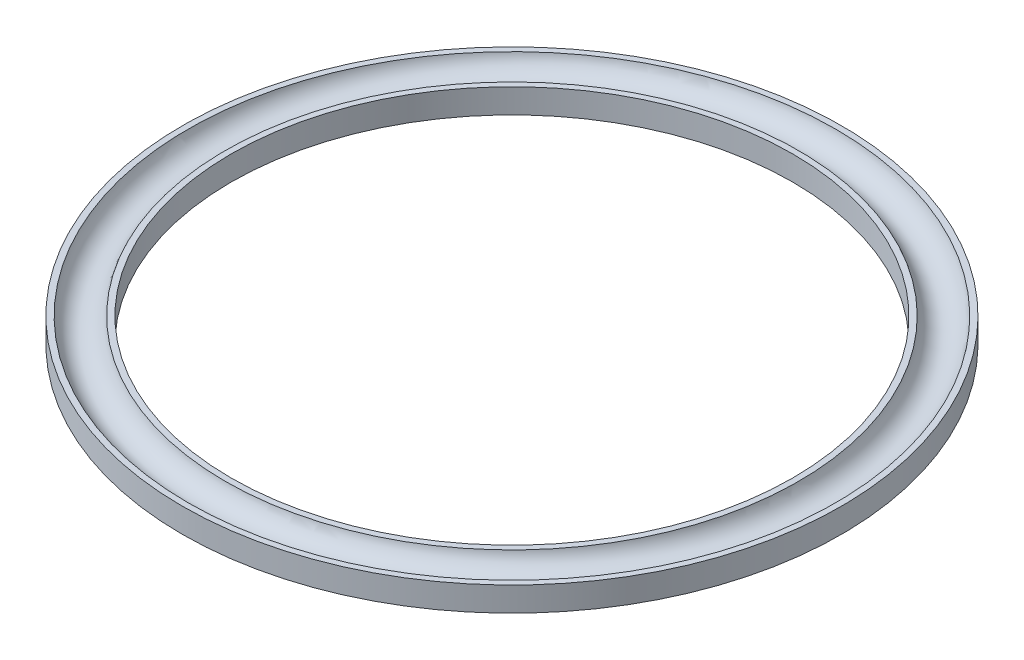
ISO-10303-21;
HEADER;
FILE_DESCRIPTION(('STEP AP214'),'2;1');
FILE_NAME('part.step','',(''),(''),'','','');
FILE_SCHEMA(('AUTOMOTIVE_DESIGN { 1 0 10303 214 1 1 1 1 }'));
ENDSEC;
DATA;
#1=APPLICATION_CONTEXT('core data for automotive mechanical design processes');
#2=APPLICATION_PROTOCOL_DEFINITION('international standard','automotive_design',2000,#1);
#3=PRODUCT_CONTEXT('',#1,'mechanical');
#4=PRODUCT('Part','Part','',(#3));
#5=PRODUCT_RELATED_PRODUCT_CATEGORY('part','',(#4));
#6=PRODUCT_DEFINITION_FORMATION('','',#4);
#7=PRODUCT_DEFINITION_CONTEXT('part definition',#1,'design');
#8=PRODUCT_DEFINITION('design','',#6,#7);
#9=PRODUCT_DEFINITION_SHAPE('','',#8);
#10=(LENGTH_UNIT() NAMED_UNIT(*) SI_UNIT(.MILLI.,.METRE.));
#11=(NAMED_UNIT(*) PLANE_ANGLE_UNIT() SI_UNIT($,.RADIAN.));
#12=(NAMED_UNIT(*) SI_UNIT($,.STERADIAN.) SOLID_ANGLE_UNIT());
#13=UNCERTAINTY_MEASURE_WITH_UNIT(LENGTH_MEASURE(1.E-05),#10,'distance_accuracy_value','');
#14=(GEOMETRIC_REPRESENTATION_CONTEXT(3) GLOBAL_UNCERTAINTY_ASSIGNED_CONTEXT((#13)) GLOBAL_UNIT_ASSIGNED_CONTEXT((#10,
#11,#12)) REPRESENTATION_CONTEXT('',''));
#15=CARTESIAN_POINT('',(0.,0.,0.));
#16=DIRECTION('',(0.,0.,1.));
#17=DIRECTION('',(1.,0.,0.));
#18=AXIS2_PLACEMENT_3D('',#15,#16,#17);
#19=CARTESIAN_POINT('',(-54.,-8.2,0.));
#20=DIRECTION('',(0.,-1.,0.));
#21=DIRECTION('',(0.,0.,-1.));
#22=AXIS2_PLACEMENT_3D('',#19,#20,#21);
#23=PLANE('',#22);
#24=DIRECTION('',(0.,0.,1.));
#25=VECTOR('',#24,1.);
#26=CARTESIAN_POINT('',(-47.0680940072169,-8.2,0.));
#27=LINE('',#26,#25);
#28=CARTESIAN_POINT('',(-47.0680940072169,-8.2,-0.708871531782178));
#29=VERTEX_POINT('',#28);
#30=CARTESIAN_POINT('',(-47.0680940072169,-8.2,0.));
#31=VERTEX_POINT('',#30);
#32=EDGE_CURVE('E50',#29,#31,#27,.T.);
#33=ORIENTED_EDGE('',*,*,#32,.F.);
#34=DIRECTION('',(0.31268572622239,0.,0.949856640034051));
#35=VECTOR('',#34,1.);
#36=CARTESIAN_POINT('',(-47.8281181124154,-8.2,-3.017624002291));
#37=LINE('',#36,#35);
#38=CARTESIAN_POINT('',(-47.8281181124154,-8.2,-3.017624002291));
#39=VERTEX_POINT('',#38);
#40=EDGE_CURVE('E175',#39,#29,#37,.T.);
#41=ORIENTED_EDGE('',*,*,#40,.F.);
#42=DIRECTION('',(1.,0.,0.));
#43=VECTOR('',#42,1.);
#44=CARTESIAN_POINT('',(-48.8892838442021,-8.2,-3.017624002291));
#45=LINE('',#44,#43);
#46=CARTESIAN_POINT('',(-48.8892838442021,-8.2,-3.017624002291));
#47=VERTEX_POINT('',#46);
#48=EDGE_CURVE('E178',#47,#39,#45,.T.);
#49=ORIENTED_EDGE('',*,*,#48,.F.);
#50=DIRECTION('',(-0.31268572622239,0.,-0.949856640034051));
#51=VECTOR('',#50,1.);
#52=CARTESIAN_POINT('',(-48.1292597390035,-8.2,-0.708871531782178));
#53=LINE('',#52,#51);
#54=CARTESIAN_POINT('',(-48.1292597390035,-8.2,-0.708871531782178));
#55=VERTEX_POINT('',#54);
#56=EDGE_CURVE('E201',#55,#47,#53,.T.);
#57=ORIENTED_EDGE('',*,*,#56,.F.);
#58=DIRECTION('',(1.,0.,0.));
#59=VECTOR('',#58,1.);
#60=CARTESIAN_POINT('',(-48.8892838442021,-8.2,-0.708871531782178));
#61=LINE('',#60,#59);
#62=CARTESIAN_POINT('',(-48.8892838442021,-8.2,-0.708871531782178));
#63=VERTEX_POINT('',#62);
#64=EDGE_CURVE('E198',#63,#55,#61,.T.);
#65=ORIENTED_EDGE('',*,*,#64,.F.);
#66=DIRECTION('',(0.,0.,-1.));
#67=VECTOR('',#66,1.);
#68=CARTESIAN_POINT('',(-48.8892838442021,-8.2,0.));
#69=LINE('',#68,#67);
#70=CARTESIAN_POINT('',(-48.8892838442021,-8.2,0.));
#71=VERTEX_POINT('',#70);
#72=EDGE_CURVE('E195',#71,#63,#69,.T.);
#73=ORIENTED_EDGE('',*,*,#72,.F.);
#74=DIRECTION('',(-1.,0.,0.));
#75=VECTOR('',#74,1.);
#76=CARTESIAN_POINT('',(-47.0680940072169,-8.2,0.));
#77=LINE('',#76,#75);
#78=EDGE_CURVE('E192',#31,#71,#77,.T.);
#79=ORIENTED_EDGE('',*,*,#78,.F.);
#80=EDGE_LOOP('',(#33,#41,#49,#57,#65,#73,#79));
#81=FACE_BOUND('',#80,.T.);
#82=DIRECTION('',(0.,0.,-1.));
#83=VECTOR('',#82,1.);
#84=CARTESIAN_POINT('',(-51.2840767794504,-8.2,0.));
#85=LINE('',#84,#83);
#86=CARTESIAN_POINT('',(-51.2840767794504,-8.2,0.));
#87=VERTEX_POINT('',#86);
#88=CARTESIAN_POINT('',(-51.2840767794504,-8.2,-1.56927617917677));
#89=VERTEX_POINT('',#88);
#90=EDGE_CURVE('E58',#87,#89,#85,.T.);
#91=ORIENTED_EDGE('',*,*,#90,.F.);
#92=DIRECTION('',(-1.,0.,0.));
#93=VECTOR('',#92,1.);
#94=CARTESIAN_POINT('',(-49.6062877170309,-8.2,0.));
#95=LINE('',#94,#93);
#96=CARTESIAN_POINT('',(-49.6062877170309,-8.2,0.));
#97=VERTEX_POINT('',#96);
#98=EDGE_CURVE('E255',#97,#87,#95,.T.);
#99=ORIENTED_EDGE('',*,*,#98,.F.);
#100=DIRECTION('',(0.,0.,1.));
#101=VECTOR('',#100,1.);
#102=CARTESIAN_POINT('',(-49.6062877170309,-8.2,-1.56927617917677));
#103=LINE('',#102,#101);
#104=CARTESIAN_POINT('',(-49.6062877170309,-8.2,-3.017624002291));
#105=VERTEX_POINT('',#104);
#106=EDGE_CURVE('E280',#105,#97,#103,.T.);
#107=ORIENTED_EDGE('',*,*,#106,.F.);
#108=DIRECTION('',(1.,0.,0.));
#109=VECTOR('',#108,1.);
#110=CARTESIAN_POINT('',(-50.0866803118262,-8.2,-3.017624002291));
#111=LINE('',#110,#109);
#112=CARTESIAN_POINT('',(-50.0866803118262,-8.2,-3.017624002291));
#113=VERTEX_POINT('',#112);
#114=EDGE_CURVE('E277',#113,#105,#111,.T.);
#115=ORIENTED_EDGE('',*,*,#114,.F.);
#116=DIRECTION('',(0.,0.,-1.));
#117=VECTOR('',#116,1.);
#118=CARTESIAN_POINT('',(-50.0866803118262,-8.2,-1.56927617917677));
#119=LINE('',#118,#117);
#120=CARTESIAN_POINT('',(-50.0866803118262,-8.2,-1.56927617917677));
#121=VERTEX_POINT('',#120);
#122=EDGE_CURVE('E274',#121,#113,#119,.T.);
#123=ORIENTED_EDGE('',*,*,#122,.F.);
#124=DIRECTION('',(1.,0.,0.));
#125=VECTOR('',#124,1.);
#126=CARTESIAN_POINT('',(-51.2840767794504,-8.2,-1.56927617917677));
#127=LINE('',#126,#125);
#128=EDGE_CURVE('E271',#89,#121,#127,.T.);
#129=ORIENTED_EDGE('',*,*,#128,.F.);
#130=EDGE_LOOP('',(#91,#99,#107,#115,#123,#129));
#131=FACE_BOUND('',#130,.T.);
#132=CARTESIAN_POINT('',(0.,-8.2,0.));
#133=DIRECTION('',(0.,1.,0.));
#134=DIRECTION('',(0.,0.,1.));
#135=AXIS2_PLACEMENT_3D('',#132,#133,#134);
#136=CIRCLE('',#135,46.);
#137=CARTESIAN_POINT('',(0.,-8.2,46.));
#138=VERTEX_POINT('',#137);
#139=EDGE_CURVE('E11',#138,#138,#136,.T.);
#140=ORIENTED_EDGE('',*,*,#139,.T.);
#141=EDGE_LOOP('',(#140));
#142=FACE_BOUND('',#141,.T.);
#143=CARTESIAN_POINT('',(0.,-8.2,0.));
#144=DIRECTION('',(0.,1.,0.));
#145=DIRECTION('',(0.,0.,1.));
#146=AXIS2_PLACEMENT_3D('',#143,#144,#145);
#147=CIRCLE('',#146,54.);
#148=CARTESIAN_POINT('',(0.,-8.2,54.));
#149=VERTEX_POINT('',#148);
#150=EDGE_CURVE('E208',#149,#149,#147,.T.);
#151=ORIENTED_EDGE('',*,*,#150,.F.);
#152=EDGE_LOOP('',(#151));
#153=FACE_BOUND('',#152,.T.);
#154=ADVANCED_FACE('F36',(#81,#131,#142,#153),#23,.T.);
#155=CARTESIAN_POINT('',(0.,30.7124446988154,0.));
#156=DIRECTION('',(0.,1.,0.));
#157=DIRECTION('',(0.,0.,1.));
#158=AXIS2_PLACEMENT_3D('',#155,#156,#157);
#159=CYLINDRICAL_SURFACE('',#158,46.);
#160=CARTESIAN_POINT('',(0.,-4.2,0.));
#161=DIRECTION('',(0.,1.,0.));
#162=DIRECTION('',(0.,0.,1.));
#163=AXIS2_PLACEMENT_3D('',#160,#161,#162);
#164=CIRCLE('',#163,46.);
#165=CARTESIAN_POINT('',(0.,-4.2,46.));
#166=VERTEX_POINT('',#165);
#167=EDGE_CURVE('E43',#166,#166,#164,.T.);
#168=ORIENTED_EDGE('',*,*,#167,.T.);
#169=EDGE_LOOP('',(#168));
#170=FACE_BOUND('',#169,.T.);
#171=ORIENTED_EDGE('',*,*,#139,.F.);
#172=EDGE_LOOP('',(#171));
#173=FACE_BOUND('',#172,.T.);
#174=ADVANCED_FACE('F308',(#170,#173),#159,.F.);
#175=CARTESIAN_POINT('',(-46.,-4.2,0.));
#176=DIRECTION('',(0.,1.,0.));
#177=DIRECTION('',(0.,0.,1.));
#178=AXIS2_PLACEMENT_3D('',#175,#176,#177);
#179=PLANE('',#178);
#180=CARTESIAN_POINT('',(0.,-4.2,0.));
#181=DIRECTION('',(0.,1.,0.));
#182=DIRECTION('',(0.,0.,1.));
#183=AXIS2_PLACEMENT_3D('',#180,#181,#182);
#184=CIRCLE('',#183,46.9586187348509);
#185=CARTESIAN_POINT('',(0.,-4.2,46.9586187348509));
#186=VERTEX_POINT('',#185);
#187=EDGE_CURVE('E303',#186,#186,#184,.T.);
#188=ORIENTED_EDGE('',*,*,#187,.T.);
#189=EDGE_LOOP('',(#188));
#190=FACE_BOUND('',#189,.T.);
#191=ORIENTED_EDGE('',*,*,#167,.F.);
#192=EDGE_LOOP('',(#191));
#193=FACE_BOUND('',#192,.T.);
#194=ADVANCED_FACE('F311',(#190,#193),#179,.T.);
#195=CARTESIAN_POINT('',(0.,-3.6,0.));
#196=DIRECTION('',(0.,1.,0.));
#197=DIRECTION('',(0.,0.,1.));
#198=AXIS2_PLACEMENT_3D('',#195,#196,#197);
#199=TOROIDAL_SURFACE('',#198,50.,3.1);
#200=CARTESIAN_POINT('',(0.,-4.2,0.));
#201=DIRECTION('',(0.,1.,0.));
#202=DIRECTION('',(0.,0.,1.));
#203=AXIS2_PLACEMENT_3D('',#200,#201,#202);
#204=CIRCLE('',#203,53.0413812651491);
#205=CARTESIAN_POINT('',(0.,-4.2,53.0413812651491));
#206=VERTEX_POINT('',#205);
#207=EDGE_CURVE('E300',#206,#206,#204,.T.);
#208=ORIENTED_EDGE('',*,*,#207,.T.);
#209=EDGE_LOOP('',(#208));
#210=FACE_BOUND('',#209,.T.);
#211=ORIENTED_EDGE('',*,*,#187,.F.);
#212=EDGE_LOOP('',(#211));
#213=FACE_BOUND('',#212,.T.);
#214=ADVANCED_FACE('F313',(#210,#213),#199,.F.);
#215=CARTESIAN_POINT('',(-53.0413812651491,-4.2,0.));
#216=DIRECTION('',(0.,1.,0.));
#217=DIRECTION('',(0.,0.,1.));
#218=AXIS2_PLACEMENT_3D('',#215,#216,#217);
#219=PLANE('',#218);
#220=CARTESIAN_POINT('',(0.,-4.2,0.));
#221=DIRECTION('',(0.,1.,0.));
#222=DIRECTION('',(0.,0.,1.));
#223=AXIS2_PLACEMENT_3D('',#220,#221,#222);
#224=CIRCLE('',#223,54.);
#225=CARTESIAN_POINT('',(0.,-4.2,54.));
#226=VERTEX_POINT('',#225);
#227=EDGE_CURVE('E297',#226,#226,#224,.T.);
#228=ORIENTED_EDGE('',*,*,#227,.T.);
#229=EDGE_LOOP('',(#228));
#230=FACE_BOUND('',#229,.T.);
#231=ORIENTED_EDGE('',*,*,#207,.F.);
#232=EDGE_LOOP('',(#231));
#233=FACE_BOUND('',#232,.T.);
#234=ADVANCED_FACE('F320',(#230,#233),#219,.T.);
#235=CARTESIAN_POINT('',(0.,30.7124446988154,0.));
#236=DIRECTION('',(0.,1.,0.));
#237=DIRECTION('',(0.,0.,1.));
#238=AXIS2_PLACEMENT_3D('',#235,#236,#237);
#239=CYLINDRICAL_SURFACE('',#238,54.);
#240=ORIENTED_EDGE('',*,*,#150,.T.);
#241=EDGE_LOOP('',(#240));
#242=FACE_BOUND('',#241,.T.);
#243=ORIENTED_EDGE('',*,*,#227,.F.);
#244=EDGE_LOOP('',(#243));
#245=FACE_BOUND('',#244,.T.);
#246=ADVANCED_FACE('F383',(#242,#245),#239,.T.);
#247=CARTESIAN_POINT('',(-51.2840767794504,-7.9,0.));
#248=DIRECTION('',(-1.,0.,0.));
#249=DIRECTION('',(0.,0.,1.));
#250=AXIS2_PLACEMENT_3D('',#247,#248,#249);
#251=PLANE('',#250);
#252=ORIENTED_EDGE('',*,*,#90,.T.);
#253=DIRECTION('',(0.,-1.,0.));
#254=VECTOR('',#253,1.);
#255=CARTESIAN_POINT('',(-51.2840767794504,-7.9,-1.56927617917677));
#256=LINE('',#255,#254);
#257=CARTESIAN_POINT('',(-51.2840767794504,-7.9,-1.56927617917677));
#258=VERTEX_POINT('',#257);
#259=EDGE_CURVE('E269',#258,#89,#256,.T.);
#260=ORIENTED_EDGE('',*,*,#259,.F.);
#261=DIRECTION('',(0.,0.,-1.));
#262=VECTOR('',#261,1.);
#263=CARTESIAN_POINT('',(-51.2840767794504,-7.9,0.));
#264=LINE('',#263,#262);
#265=CARTESIAN_POINT('',(-51.2840767794504,-7.9,0.));
#266=VERTEX_POINT('',#265);
#267=EDGE_CURVE('E251',#266,#258,#264,.T.);
#268=ORIENTED_EDGE('',*,*,#267,.F.);
#269=DIRECTION('',(0.,-1.,0.));
#270=VECTOR('',#269,1.);
#271=CARTESIAN_POINT('',(-51.2840767794504,-7.9,0.));
#272=LINE('',#271,#270);
#273=EDGE_CURVE('E193',#266,#87,#272,.T.);
#274=ORIENTED_EDGE('',*,*,#273,.T.);
#275=EDGE_LOOP('',(#252,#260,#268,#274));
#276=FACE_BOUND('',#275,.T.);
#277=ADVANCED_FACE('F359',(#276),#251,.F.);
#278=CARTESIAN_POINT('',(-49.6062877170309,-7.9,0.));
#279=DIRECTION('',(0.,0.,1.));
#280=DIRECTION('',(1.,0.,0.));
#281=AXIS2_PLACEMENT_3D('',#278,#279,#280);
#282=PLANE('',#281);
#283=ORIENTED_EDGE('',*,*,#98,.T.);
#284=ORIENTED_EDGE('',*,*,#273,.F.);
#285=DIRECTION('',(-1.,0.,0.));
#286=VECTOR('',#285,1.);
#287=CARTESIAN_POINT('',(-49.6062877170309,-7.9,0.));
#288=LINE('',#287,#286);
#289=CARTESIAN_POINT('',(-49.6062877170309,-7.9,0.));
#290=VERTEX_POINT('',#289);
#291=EDGE_CURVE('E266',#290,#266,#288,.T.);
#292=ORIENTED_EDGE('',*,*,#291,.F.);
#293=DIRECTION('',(0.,-1.,0.));
#294=VECTOR('',#293,1.);
#295=CARTESIAN_POINT('',(-49.6062877170309,-7.9,0.));
#296=LINE('',#295,#294);
#297=EDGE_CURVE('E286',#290,#97,#296,.T.);
#298=ORIENTED_EDGE('',*,*,#297,.T.);
#299=EDGE_LOOP('',(#283,#284,#292,#298));
#300=FACE_BOUND('',#299,.T.);
#301=ADVANCED_FACE('F377',(#300),#282,.F.);
#302=CARTESIAN_POINT('',(-49.6062877170309,-7.9,-1.56927617917677));
#303=DIRECTION('',(1.,0.,0.));
#304=DIRECTION('',(0.,0.,-1.));
#305=AXIS2_PLACEMENT_3D('',#302,#303,#304);
#306=PLANE('',#305);
#307=ORIENTED_EDGE('',*,*,#106,.T.);
#308=ORIENTED_EDGE('',*,*,#297,.F.);
#309=DIRECTION('',(0.,0.,1.));
#310=VECTOR('',#309,1.);
#311=CARTESIAN_POINT('',(-49.6062877170309,-7.9,-3.017624002291));
#312=LINE('',#311,#310);
#313=CARTESIAN_POINT('',(-49.6062877170309,-7.9,-3.017624002291));
#314=VERTEX_POINT('',#313);
#315=EDGE_CURVE('E264',#314,#290,#312,.T.);
#316=ORIENTED_EDGE('',*,*,#315,.F.);
#317=DIRECTION('',(0.,-1.,0.));
#318=VECTOR('',#317,1.);
#319=CARTESIAN_POINT('',(-49.6062877170309,-7.9,-3.017624002291));
#320=LINE('',#319,#318);
#321=EDGE_CURVE('E288',#314,#105,#320,.T.);
#322=ORIENTED_EDGE('',*,*,#321,.T.);
#323=EDGE_LOOP('',(#307,#308,#316,#322));
#324=FACE_BOUND('',#323,.T.);
#325=ADVANCED_FACE('F374',(#324),#306,.F.);
#326=CARTESIAN_POINT('',(-50.0866803118262,-7.9,-3.017624002291));
#327=DIRECTION('',(0.,0.,-1.));
#328=DIRECTION('',(-1.,0.,0.));
#329=AXIS2_PLACEMENT_3D('',#326,#327,#328);
#330=PLANE('',#329);
#331=ORIENTED_EDGE('',*,*,#114,.T.);
#332=ORIENTED_EDGE('',*,*,#321,.F.);
#333=DIRECTION('',(1.,0.,0.));
#334=VECTOR('',#333,1.);
#335=CARTESIAN_POINT('',(-50.0866803118262,-7.9,-3.017624002291));
#336=LINE('',#335,#334);
#337=CARTESIAN_POINT('',(-50.0866803118262,-7.9,-3.017624002291));
#338=VERTEX_POINT('',#337);
#339=EDGE_CURVE('E261',#338,#314,#336,.T.);
#340=ORIENTED_EDGE('',*,*,#339,.F.);
#341=DIRECTION('',(0.,-1.,0.));
#342=VECTOR('',#341,1.);
#343=CARTESIAN_POINT('',(-50.0866803118262,-7.9,-3.017624002291));
#344=LINE('',#343,#342);
#345=EDGE_CURVE('E290',#338,#113,#344,.T.);
#346=ORIENTED_EDGE('',*,*,#345,.T.);
#347=EDGE_LOOP('',(#331,#332,#340,#346));
#348=FACE_BOUND('',#347,.T.);
#349=ADVANCED_FACE('F370',(#348),#330,.F.);
#350=CARTESIAN_POINT('',(-50.0866803118262,-7.9,-1.56927617917677));
#351=DIRECTION('',(-1.,0.,0.));
#352=DIRECTION('',(0.,0.,1.));
#353=AXIS2_PLACEMENT_3D('',#350,#351,#352);
#354=PLANE('',#353);
#355=ORIENTED_EDGE('',*,*,#122,.T.);
#356=ORIENTED_EDGE('',*,*,#345,.F.);
#357=DIRECTION('',(0.,0.,-1.));
#358=VECTOR('',#357,1.);
#359=CARTESIAN_POINT('',(-50.0866803118262,-7.9,-1.56927617917677));
#360=LINE('',#359,#358);
#361=CARTESIAN_POINT('',(-50.0866803118262,-7.9,-1.56927617917677));
#362=VERTEX_POINT('',#361);
#363=EDGE_CURVE('E258',#362,#338,#360,.T.);
#364=ORIENTED_EDGE('',*,*,#363,.F.);
#365=DIRECTION('',(0.,-1.,0.));
#366=VECTOR('',#365,1.);
#367=CARTESIAN_POINT('',(-50.0866803118262,-7.9,-1.56927617917677));
#368=LINE('',#367,#366);
#369=EDGE_CURVE('E292',#362,#121,#368,.T.);
#370=ORIENTED_EDGE('',*,*,#369,.T.);
#371=EDGE_LOOP('',(#355,#356,#364,#370));
#372=FACE_BOUND('',#371,.T.);
#373=ADVANCED_FACE('F365',(#372),#354,.F.);
#374=CARTESIAN_POINT('',(-51.2840767794504,-7.9,-1.56927617917677));
#375=DIRECTION('',(0.,0.,-1.));
#376=DIRECTION('',(-1.,0.,0.));
#377=AXIS2_PLACEMENT_3D('',#374,#375,#376);
#378=PLANE('',#377);
#379=ORIENTED_EDGE('',*,*,#128,.T.);
#380=ORIENTED_EDGE('',*,*,#369,.F.);
#381=DIRECTION('',(1.,0.,0.));
#382=VECTOR('',#381,1.);
#383=CARTESIAN_POINT('',(-51.2840767794504,-7.9,-1.56927617917677));
#384=LINE('',#383,#382);
#385=EDGE_CURVE('E254',#258,#362,#384,.T.);
#386=ORIENTED_EDGE('',*,*,#385,.F.);
#387=ORIENTED_EDGE('',*,*,#259,.T.);
#388=EDGE_LOOP('',(#379,#380,#386,#387));
#389=FACE_BOUND('',#388,.T.);
#390=ADVANCED_FACE('F354',(#389),#378,.F.);
#391=CARTESIAN_POINT('',(0.,-7.9,0.));
#392=DIRECTION('',(0.,-1.,0.));
#393=DIRECTION('',(0.,0.,-1.));
#394=AXIS2_PLACEMENT_3D('',#391,#392,#393);
#395=PLANE('',#394);
#396=DIRECTION('',(-1.,0.,0.));
#397=VECTOR('',#396,1.);
#398=CARTESIAN_POINT('',(-50.7678339910136,-7.9,-0.393389827737495));
#399=LINE('',#398,#397);
#400=CARTESIAN_POINT('',(-50.0866803118262,-7.9,-0.393389827737495));
#401=VERTEX_POINT('',#400);
#402=CARTESIAN_POINT('',(-50.7678339910136,-7.9,-0.393389827737495));
#403=VERTEX_POINT('',#402);
#404=EDGE_CURVE('E228',#401,#403,#399,.T.);
#405=ORIENTED_EDGE('',*,*,#404,.F.);
#406=DIRECTION('',(0.,0.,1.));
#407=VECTOR('',#406,1.);
#408=CARTESIAN_POINT('',(-50.0866803118262,-7.9,-0.393389827737495));
#409=LINE('',#408,#407);
#410=CARTESIAN_POINT('',(-50.0866803118262,-7.9,-0.923972693630825));
#411=VERTEX_POINT('',#410);
#412=EDGE_CURVE('E225',#411,#401,#409,.T.);
#413=ORIENTED_EDGE('',*,*,#412,.F.);
#414=DIRECTION('',(1.,0.,0.));
#415=VECTOR('',#414,1.);
#416=CARTESIAN_POINT('',(-50.0866803118262,-7.9,-0.923972693630825));
#417=LINE('',#416,#415);
#418=CARTESIAN_POINT('',(-50.7678339910136,-7.9,-0.923972693630825));
#419=VERTEX_POINT('',#418);
#420=EDGE_CURVE('E221',#419,#411,#417,.T.);
#421=ORIENTED_EDGE('',*,*,#420,.F.);
#422=DIRECTION('',(0.,0.,-1.));
#423=VECTOR('',#422,1.);
#424=CARTESIAN_POINT('',(-50.7678339910136,-7.9,-0.923972693630825));
#425=LINE('',#424,#423);
#426=EDGE_CURVE('E218',#403,#419,#425,.T.);
#427=ORIENTED_EDGE('',*,*,#426,.F.);
#428=EDGE_LOOP('',(#405,#413,#421,#427));
#429=FACE_BOUND('',#428,.T.);
#430=ORIENTED_EDGE('',*,*,#267,.T.);
#431=ORIENTED_EDGE('',*,*,#385,.T.);
#432=ORIENTED_EDGE('',*,*,#363,.T.);
#433=ORIENTED_EDGE('',*,*,#339,.T.);
#434=ORIENTED_EDGE('',*,*,#315,.T.);
#435=ORIENTED_EDGE('',*,*,#291,.T.);
#436=EDGE_LOOP('',(#430,#431,#432,#433,#434,#435));
#437=FACE_BOUND('',#436,.T.);
#438=ADVANCED_FACE('F351',(#429,#437),#395,.T.);
#439=CARTESIAN_POINT('',(-50.7678339910136,-7.9,-0.923972693630825));
#440=DIRECTION('',(-1.,0.,0.));
#441=DIRECTION('',(0.,0.,1.));
#442=AXIS2_PLACEMENT_3D('',#439,#440,#441);
#443=PLANE('',#442);
#444=DIRECTION('',(0.,0.,-1.));
#445=VECTOR('',#444,1.);
#446=CARTESIAN_POINT('',(-50.7678339910136,-8.2,-0.923972693630825));
#447=LINE('',#446,#445);
#448=CARTESIAN_POINT('',(-50.7678339910136,-8.2,-0.393389827737495));
#449=VERTEX_POINT('',#448);
#450=CARTESIAN_POINT('',(-50.7678339910136,-8.2,-0.923972693630825));
#451=VERTEX_POINT('',#450);
#452=EDGE_CURVE('E232',#449,#451,#447,.T.);
#453=ORIENTED_EDGE('',*,*,#452,.F.);
#454=DIRECTION('',(0.,-1.,0.));
#455=VECTOR('',#454,1.);
#456=CARTESIAN_POINT('',(-50.7678339910136,-7.9,-0.393389827737495));
#457=LINE('',#456,#455);
#458=EDGE_CURVE('E243',#403,#449,#457,.T.);
#459=ORIENTED_EDGE('',*,*,#458,.F.);
#460=ORIENTED_EDGE('',*,*,#426,.T.);
#461=DIRECTION('',(0.,-1.,0.));
#462=VECTOR('',#461,1.);
#463=CARTESIAN_POINT('',(-50.7678339910136,-7.9,-0.923972693630825));
#464=LINE('',#463,#462);
#465=EDGE_CURVE('E231',#419,#451,#464,.T.);
#466=ORIENTED_EDGE('',*,*,#465,.T.);
#467=EDGE_LOOP('',(#453,#459,#460,#466));
#468=FACE_BOUND('',#467,.T.);
#469=ADVANCED_FACE('F342',(#468),#443,.T.);
#470=CARTESIAN_POINT('',(-50.7678339910136,-7.9,-0.393389827737495));
#471=DIRECTION('',(0.,0.,1.));
#472=DIRECTION('',(1.,0.,0.));
#473=AXIS2_PLACEMENT_3D('',#470,#471,#472);
#474=PLANE('',#473);
#475=DIRECTION('',(-1.,0.,0.));
#476=VECTOR('',#475,1.);
#477=CARTESIAN_POINT('',(-50.7678339910136,-8.2,-0.393389827737495));
#478=LINE('',#477,#476);
#479=CARTESIAN_POINT('',(-50.0866803118262,-8.2,-0.393389827737495));
#480=VERTEX_POINT('',#479);
#481=EDGE_CURVE('E222',#480,#449,#478,.T.);
#482=ORIENTED_EDGE('',*,*,#481,.F.);
#483=DIRECTION('',(0.,-1.,0.));
#484=VECTOR('',#483,1.);
#485=CARTESIAN_POINT('',(-50.0866803118262,-7.9,-0.393389827737495));
#486=LINE('',#485,#484);
#487=EDGE_CURVE('E245',#401,#480,#486,.T.);
#488=ORIENTED_EDGE('',*,*,#487,.F.);
#489=ORIENTED_EDGE('',*,*,#404,.T.);
#490=ORIENTED_EDGE('',*,*,#458,.T.);
#491=EDGE_LOOP('',(#482,#488,#489,#490));
#492=FACE_BOUND('',#491,.T.);
#493=ADVANCED_FACE('F338',(#492),#474,.T.);
#494=CARTESIAN_POINT('',(-50.0866803118262,-7.9,-0.393389827737495));
#495=DIRECTION('',(1.,0.,0.));
#496=DIRECTION('',(0.,0.,-1.));
#497=AXIS2_PLACEMENT_3D('',#494,#495,#496);
#498=PLANE('',#497);
#499=DIRECTION('',(0.,0.,1.));
#500=VECTOR('',#499,1.);
#501=CARTESIAN_POINT('',(-50.0866803118262,-8.2,-0.393389827737495));
#502=LINE('',#501,#500);
#503=CARTESIAN_POINT('',(-50.0866803118262,-8.2,-0.923972693630825));
#504=VERTEX_POINT('',#503);
#505=EDGE_CURVE('E238',#504,#480,#502,.T.);
#506=ORIENTED_EDGE('',*,*,#505,.F.);
#507=DIRECTION('',(0.,-1.,0.));
#508=VECTOR('',#507,1.);
#509=CARTESIAN_POINT('',(-50.0866803118262,-7.9,-0.923972693630825));
#510=LINE('',#509,#508);
#511=EDGE_CURVE('E247',#411,#504,#510,.T.);
#512=ORIENTED_EDGE('',*,*,#511,.F.);
#513=ORIENTED_EDGE('',*,*,#412,.T.);
#514=ORIENTED_EDGE('',*,*,#487,.T.);
#515=EDGE_LOOP('',(#506,#512,#513,#514));
#516=FACE_BOUND('',#515,.T.);
#517=ADVANCED_FACE('F349',(#516),#498,.T.);
#518=CARTESIAN_POINT('',(-50.0866803118262,-7.9,-0.923972693630825));
#519=DIRECTION('',(0.,0.,-1.));
#520=DIRECTION('',(-1.,0.,0.));
#521=AXIS2_PLACEMENT_3D('',#518,#519,#520);
#522=PLANE('',#521);
#523=DIRECTION('',(1.,0.,0.));
#524=VECTOR('',#523,1.);
#525=CARTESIAN_POINT('',(-50.0866803118262,-8.2,-0.923972693630825));
#526=LINE('',#525,#524);
#527=EDGE_CURVE('E235',#451,#504,#526,.T.);
#528=ORIENTED_EDGE('',*,*,#527,.F.);
#529=ORIENTED_EDGE('',*,*,#465,.F.);
#530=ORIENTED_EDGE('',*,*,#420,.T.);
#531=ORIENTED_EDGE('',*,*,#511,.T.);
#532=EDGE_LOOP('',(#528,#529,#530,#531));
#533=FACE_BOUND('',#532,.T.);
#534=ADVANCED_FACE('F346',(#533),#522,.T.);
#535=CARTESIAN_POINT('',(-47.0680940072169,-7.9,0.));
#536=DIRECTION('',(1.,0.,0.));
#537=DIRECTION('',(0.,0.,-1.));
#538=AXIS2_PLACEMENT_3D('',#535,#536,#537);
#539=PLANE('',#538);
#540=ORIENTED_EDGE('',*,*,#32,.T.);
#541=DIRECTION('',(0.,-1.,0.));
#542=VECTOR('',#541,1.);
#543=CARTESIAN_POINT('',(-47.0680940072169,-7.9,0.));
#544=LINE('',#543,#542);
#545=CARTESIAN_POINT('',(-47.0680940072169,-7.9,0.));
#546=VERTEX_POINT('',#545);
#547=EDGE_CURVE('E152',#546,#31,#544,.T.);
#548=ORIENTED_EDGE('',*,*,#547,.F.);
#549=DIRECTION('',(0.,0.,1.));
#550=VECTOR('',#549,1.);
#551=CARTESIAN_POINT('',(-47.0680940072169,-7.9,0.));
#552=LINE('',#551,#550);
#553=CARTESIAN_POINT('',(-47.0680940072169,-7.9,-0.708871531782178));
#554=VERTEX_POINT('',#553);
#555=EDGE_CURVE('E156',#554,#546,#552,.T.);
#556=ORIENTED_EDGE('',*,*,#555,.F.);
#557=DIRECTION('',(0.,-1.,0.));
#558=VECTOR('',#557,1.);
#559=CARTESIAN_POINT('',(-47.0680940072169,-7.9,-0.708871531782178));
#560=LINE('',#559,#558);
#561=EDGE_CURVE('E206',#554,#29,#560,.T.);
#562=ORIENTED_EDGE('',*,*,#561,.T.);
#563=EDGE_LOOP('',(#540,#548,#556,#562));
#564=FACE_BOUND('',#563,.T.);
#565=ADVANCED_FACE('F154',(#564),#539,.F.);
#566=CARTESIAN_POINT('',(-47.8281181124154,-7.9,-3.017624002291));
#567=DIRECTION('',(0.949856640034051,0.,-0.31268572622239));
#568=DIRECTION('',(-0.31268572622239,0.,-0.949856640034051));
#569=AXIS2_PLACEMENT_3D('',#566,#567,#568);
#570=PLANE('',#569);
#571=ORIENTED_EDGE('',*,*,#40,.T.);
#572=ORIENTED_EDGE('',*,*,#561,.F.);
#573=DIRECTION('',(0.31268572622239,0.,0.949856640034051));
#574=VECTOR('',#573,1.);
#575=CARTESIAN_POINT('',(-47.8281181124154,-7.9,-3.017624002291));
#576=LINE('',#575,#574);
#577=CARTESIAN_POINT('',(-47.8281181124154,-7.9,-3.017624002291));
#578=VERTEX_POINT('',#577);
#579=EDGE_CURVE('E162',#578,#554,#576,.T.);
#580=ORIENTED_EDGE('',*,*,#579,.F.);
#581=DIRECTION('',(0.,-1.,0.));
#582=VECTOR('',#581,1.);
#583=CARTESIAN_POINT('',(-47.8281181124154,-7.9,-3.017624002291));
#584=LINE('',#583,#582);
#585=EDGE_CURVE('E209',#578,#39,#584,.T.);
#586=ORIENTED_EDGE('',*,*,#585,.T.);
#587=EDGE_LOOP('',(#571,#572,#580,#586));
#588=FACE_BOUND('',#587,.T.);
#589=ADVANCED_FACE('F420',(#588),#570,.F.);
#590=CARTESIAN_POINT('',(-48.8892838442021,-7.9,-3.017624002291));
#591=DIRECTION('',(0.,0.,-1.));
#592=DIRECTION('',(-1.,0.,0.));
#593=AXIS2_PLACEMENT_3D('',#590,#591,#592);
#594=PLANE('',#593);
#595=ORIENTED_EDGE('',*,*,#48,.T.);
#596=ORIENTED_EDGE('',*,*,#585,.F.);
#597=DIRECTION('',(1.,0.,0.));
#598=VECTOR('',#597,1.);
#599=CARTESIAN_POINT('',(-48.8892838442021,-7.9,-3.017624002291));
#600=LINE('',#599,#598);
#601=CARTESIAN_POINT('',(-48.8892838442021,-7.9,-3.017624002291));
#602=VERTEX_POINT('',#601);
#603=EDGE_CURVE('E188',#602,#578,#600,.T.);
#604=ORIENTED_EDGE('',*,*,#603,.F.);
#605=DIRECTION('',(0.,-1.,0.));
#606=VECTOR('',#605,1.);
#607=CARTESIAN_POINT('',(-48.8892838442021,-7.9,-3.017624002291));
#608=LINE('',#607,#606);
#609=EDGE_CURVE('E211',#602,#47,#608,.T.);
#610=ORIENTED_EDGE('',*,*,#609,.T.);
#611=EDGE_LOOP('',(#595,#596,#604,#610));
#612=FACE_BOUND('',#611,.T.);
#613=ADVANCED_FACE('F434',(#612),#594,.F.);
#614=CARTESIAN_POINT('',(-48.1292597390035,-7.9,-0.708871531782178));
#615=DIRECTION('',(-0.949856640034051,0.,0.31268572622239));
#616=DIRECTION('',(0.31268572622239,0.,0.949856640034051));
#617=AXIS2_PLACEMENT_3D('',#614,#615,#616);
#618=PLANE('',#617);
#619=ORIENTED_EDGE('',*,*,#56,.T.);
#620=ORIENTED_EDGE('',*,*,#609,.F.);
#621=DIRECTION('',(-0.31268572622239,0.,-0.949856640034051));
#622=VECTOR('',#621,1.);
#623=CARTESIAN_POINT('',(-48.1292597390035,-7.9,-0.708871531782178));
#624=LINE('',#623,#622);
#625=CARTESIAN_POINT('',(-48.1292597390035,-7.9,-0.708871531782178));
#626=VERTEX_POINT('',#625);
#627=EDGE_CURVE('E185',#626,#602,#624,.T.);
#628=ORIENTED_EDGE('',*,*,#627,.F.);
#629=DIRECTION('',(0.,-1.,0.));
#630=VECTOR('',#629,1.);
#631=CARTESIAN_POINT('',(-48.1292597390035,-7.9,-0.708871531782178));
#632=LINE('',#631,#630);
#633=EDGE_CURVE('E213',#626,#55,#632,.T.);
#634=ORIENTED_EDGE('',*,*,#633,.T.);
#635=EDGE_LOOP('',(#619,#620,#628,#634));
#636=FACE_BOUND('',#635,.T.);
#637=ADVANCED_FACE('F430',(#636),#618,.F.);
#638=CARTESIAN_POINT('',(-48.8892838442021,-7.9,-0.708871531782178));
#639=DIRECTION('',(0.,0.,-1.));
#640=DIRECTION('',(-1.,0.,0.));
#641=AXIS2_PLACEMENT_3D('',#638,#639,#640);
#642=PLANE('',#641);
#643=ORIENTED_EDGE('',*,*,#64,.T.);
#644=ORIENTED_EDGE('',*,*,#633,.F.);
#645=DIRECTION('',(1.,0.,0.));
#646=VECTOR('',#645,1.);
#647=CARTESIAN_POINT('',(-48.8892838442021,-7.9,-0.708871531782178));
#648=LINE('',#647,#646);
#649=CARTESIAN_POINT('',(-48.8892838442021,-7.9,-0.708871531782178));
#650=VERTEX_POINT('',#649);
#651=EDGE_CURVE('E182',#650,#626,#648,.T.);
#652=ORIENTED_EDGE('',*,*,#651,.F.);
#653=DIRECTION('',(0.,-1.,0.));
#654=VECTOR('',#653,1.);
#655=CARTESIAN_POINT('',(-48.8892838442021,-7.9,-0.708871531782178));
#656=LINE('',#655,#654);
#657=EDGE_CURVE('E215',#650,#63,#656,.T.);
#658=ORIENTED_EDGE('',*,*,#657,.T.);
#659=EDGE_LOOP('',(#643,#644,#652,#658));
#660=FACE_BOUND('',#659,.T.);
#661=ADVANCED_FACE('F426',(#660),#642,.F.);
#662=CARTESIAN_POINT('',(-48.8892838442021,-7.9,0.));
#663=DIRECTION('',(-1.,0.,0.));
#664=DIRECTION('',(0.,0.,1.));
#665=AXIS2_PLACEMENT_3D('',#662,#663,#664);
#666=PLANE('',#665);
#667=ORIENTED_EDGE('',*,*,#72,.T.);
#668=ORIENTED_EDGE('',*,*,#657,.F.);
#669=DIRECTION('',(0.,0.,-1.));
#670=VECTOR('',#669,1.);
#671=CARTESIAN_POINT('',(-48.8892838442021,-7.9,0.));
#672=LINE('',#671,#670);
#673=CARTESIAN_POINT('',(-48.8892838442021,-7.9,0.));
#674=VERTEX_POINT('',#673);
#675=EDGE_CURVE('E170',#674,#650,#672,.T.);
#676=ORIENTED_EDGE('',*,*,#675,.F.);
#677=DIRECTION('',(0.,-1.,0.));
#678=VECTOR('',#677,1.);
#679=CARTESIAN_POINT('',(-48.8892838442021,-7.9,0.));
#680=LINE('',#679,#678);
#681=EDGE_CURVE('E161',#674,#71,#680,.T.);
#682=ORIENTED_EDGE('',*,*,#681,.T.);
#683=EDGE_LOOP('',(#667,#668,#676,#682));
#684=FACE_BOUND('',#683,.T.);
#685=ADVANCED_FACE('F423',(#684),#666,.F.);
#686=CARTESIAN_POINT('',(-47.0680940072169,-7.9,0.));
#687=DIRECTION('',(0.,0.,1.));
#688=DIRECTION('',(1.,0.,0.));
#689=AXIS2_PLACEMENT_3D('',#686,#687,#688);
#690=PLANE('',#689);
#691=ORIENTED_EDGE('',*,*,#78,.T.);
#692=ORIENTED_EDGE('',*,*,#681,.F.);
#693=DIRECTION('',(-1.,0.,0.));
#694=VECTOR('',#693,1.);
#695=CARTESIAN_POINT('',(-47.0680940072169,-7.9,0.));
#696=LINE('',#695,#694);
#697=EDGE_CURVE('E165',#546,#674,#696,.T.);
#698=ORIENTED_EDGE('',*,*,#697,.F.);
#699=ORIENTED_EDGE('',*,*,#547,.T.);
#700=EDGE_LOOP('',(#691,#692,#698,#699));
#701=FACE_BOUND('',#700,.T.);
#702=ADVANCED_FACE('F166',(#701),#690,.F.);
#703=CARTESIAN_POINT('',(0.,-7.9,0.));
#704=DIRECTION('',(0.,-1.,0.));
#705=DIRECTION('',(0.,0.,-1.));
#706=AXIS2_PLACEMENT_3D('',#703,#704,#705);
#707=PLANE('',#706);
#708=ORIENTED_EDGE('',*,*,#555,.T.);
#709=ORIENTED_EDGE('',*,*,#697,.T.);
#710=ORIENTED_EDGE('',*,*,#675,.T.);
#711=ORIENTED_EDGE('',*,*,#651,.T.);
#712=ORIENTED_EDGE('',*,*,#627,.T.);
#713=ORIENTED_EDGE('',*,*,#603,.T.);
#714=ORIENTED_EDGE('',*,*,#579,.T.);
#715=EDGE_LOOP('',(#708,#709,#710,#711,#712,#713,#714));
#716=FACE_BOUND('',#715,.T.);
#717=ADVANCED_FACE('F172',(#716),#707,.T.);
#718=ORIENTED_EDGE('',*,*,#481,.T.);
#719=ORIENTED_EDGE('',*,*,#452,.T.);
#720=ORIENTED_EDGE('',*,*,#527,.T.);
#721=ORIENTED_EDGE('',*,*,#505,.T.);
#722=EDGE_LOOP('',(#718,#719,#720,#721));
#723=FACE_BOUND('',#722,.T.);
#724=ADVANCED_FACE('F325',(#723),#23,.T.);
#725=CLOSED_SHELL('',(#154,#174,#194,#214,#234,#246,#277,#301,#325,#349,#373,#390,#438,#469,
#493,#517,#534,#565,#589,#613,#637,#661,#685,#702,#717,#724));
#726=MANIFOLD_SOLID_BREP('B2',#725);
#727=ADVANCED_BREP_SHAPE_REPRESENTATION('',(#18,#726),#14);
#728=SHAPE_DEFINITION_REPRESENTATION(#9,#727);
ENDSEC;
END-ISO-10303-21;
